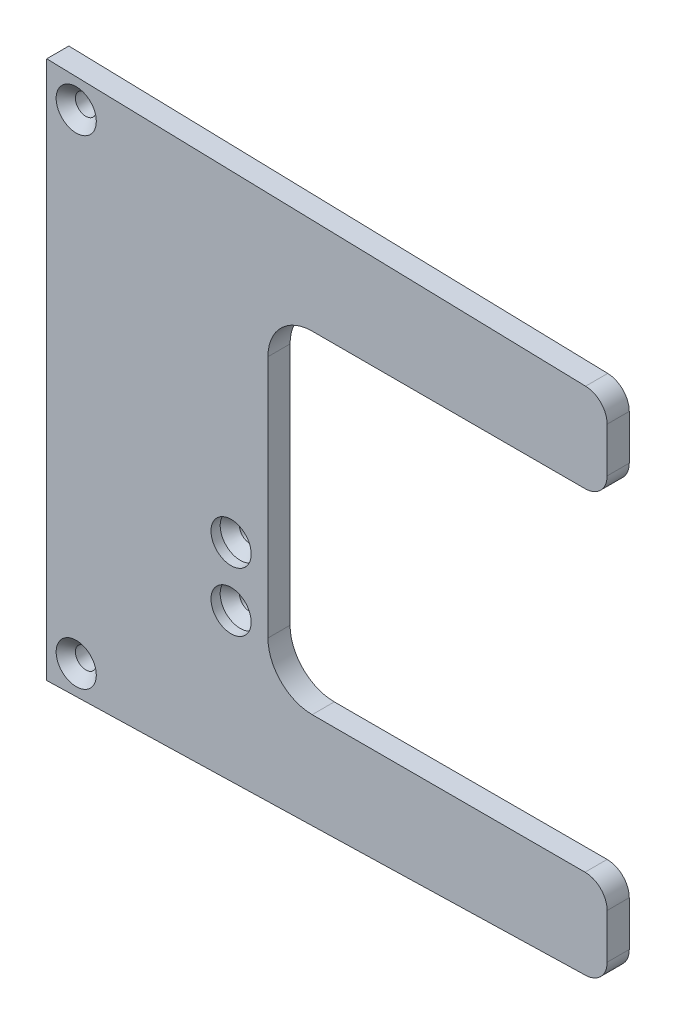
ISO-10303-21;
HEADER;
FILE_DESCRIPTION(('STEP AP214'),'2;1');
FILE_NAME('part.step','',(''),(''),'','','');
FILE_SCHEMA(('AUTOMOTIVE_DESIGN { 1 0 10303 214 1 1 1 1 }'));
ENDSEC;
DATA;
#1=APPLICATION_CONTEXT('core data for automotive mechanical design processes');
#2=APPLICATION_PROTOCOL_DEFINITION('international standard','automotive_design',2000,#1);
#3=PRODUCT_CONTEXT('',#1,'mechanical');
#4=PRODUCT('Part','Part','',(#3));
#5=PRODUCT_RELATED_PRODUCT_CATEGORY('part','',(#4));
#6=PRODUCT_DEFINITION_FORMATION('','',#4);
#7=PRODUCT_DEFINITION_CONTEXT('part definition',#1,'design');
#8=PRODUCT_DEFINITION('design','',#6,#7);
#9=PRODUCT_DEFINITION_SHAPE('','',#8);
#10=(LENGTH_UNIT() NAMED_UNIT(*) SI_UNIT(.MILLI.,.METRE.));
#11=(NAMED_UNIT(*) PLANE_ANGLE_UNIT() SI_UNIT($,.RADIAN.));
#12=(NAMED_UNIT(*) SI_UNIT($,.STERADIAN.) SOLID_ANGLE_UNIT());
#13=UNCERTAINTY_MEASURE_WITH_UNIT(LENGTH_MEASURE(1.E-05),#10,'distance_accuracy_value','');
#14=(GEOMETRIC_REPRESENTATION_CONTEXT(3) GLOBAL_UNCERTAINTY_ASSIGNED_CONTEXT((#13)) GLOBAL_UNIT_ASSIGNED_CONTEXT((#10,
#11,#12)) REPRESENTATION_CONTEXT('',''));
#15=CARTESIAN_POINT('',(0.,0.,0.));
#16=DIRECTION('',(0.,0.,1.));
#17=DIRECTION('',(1.,0.,0.));
#18=AXIS2_PLACEMENT_3D('',#15,#16,#17);
#19=CARTESIAN_POINT('',(-47.625,115.91925,9.525));
#20=DIRECTION('',(1.,0.,0.));
#21=DIRECTION('',(0.,1.,0.));
#22=AXIS2_PLACEMENT_3D('',#19,#20,#21);
#23=PLANE('',#22);
#24=DIRECTION('',(0.,-1.,0.));
#25=VECTOR('',#24,1.);
#26=CARTESIAN_POINT('',(-47.625,115.91925,0.));
#27=LINE('',#26,#25);
#28=CARTESIAN_POINT('',(-47.625,115.91925,0.));
#29=VERTEX_POINT('',#28);
#30=CARTESIAN_POINT('',(-47.625,-115.91925,0.));
#31=VERTEX_POINT('',#30);
#32=EDGE_CURVE('E163',#29,#31,#27,.T.);
#33=ORIENTED_EDGE('',*,*,#32,.T.);
#34=DIRECTION('',(0.,0.,-1.));
#35=VECTOR('',#34,1.);
#36=CARTESIAN_POINT('',(-47.625,-115.91925,9.525));
#37=LINE('',#36,#35);
#38=CARTESIAN_POINT('',(-47.625,-115.91925,9.525));
#39=VERTEX_POINT('',#38);
#40=EDGE_CURVE('E143',#39,#31,#37,.T.);
#41=ORIENTED_EDGE('',*,*,#40,.F.);
#42=DIRECTION('',(0.,-1.,0.));
#43=VECTOR('',#42,1.);
#44=CARTESIAN_POINT('',(-47.625,115.91925,9.525));
#45=LINE('',#44,#43);
#46=CARTESIAN_POINT('',(-47.625,115.91925,9.525));
#47=VERTEX_POINT('',#46);
#48=EDGE_CURVE('E152',#47,#39,#45,.T.);
#49=ORIENTED_EDGE('',*,*,#48,.F.);
#50=DIRECTION('',(0.,0.,-1.));
#51=VECTOR('',#50,1.);
#52=CARTESIAN_POINT('',(-47.625,115.91925,9.525));
#53=LINE('',#52,#51);
#54=EDGE_CURVE('E164',#47,#29,#53,.T.);
#55=ORIENTED_EDGE('',*,*,#54,.T.);
#56=EDGE_LOOP('',(#33,#41,#49,#55));
#57=FACE_BOUND('',#56,.T.);
#58=ADVANCED_FACE('F38',(#57),#23,.F.);
#59=CARTESIAN_POINT('',(47.625,115.91925,9.525));
#60=DIRECTION('',(-1.,0.,0.));
#61=DIRECTION('',(0.,-1.,0.));
#62=AXIS2_PLACEMENT_3D('',#59,#60,#61);
#63=PLANE('',#62);
#64=DIRECTION('',(0.,1.,0.));
#65=VECTOR('',#64,1.);
#66=CARTESIAN_POINT('',(47.625,115.91925,9.525));
#67=LINE('',#66,#65);
#68=CARTESIAN_POINT('',(47.625,-52.4505871253568,9.525));
#69=VERTEX_POINT('',#68);
#70=CARTESIAN_POINT('',(47.625,52.4505871253569,9.525));
#71=VERTEX_POINT('',#70);
#72=EDGE_CURVE('E158',#69,#71,#67,.T.);
#73=ORIENTED_EDGE('',*,*,#72,.F.);
#74=DIRECTION('',(0.,0.,1.));
#75=VECTOR('',#74,1.);
#76=CARTESIAN_POINT('',(47.625,-52.4505871253569,9.525));
#77=LINE('',#76,#75);
#78=CARTESIAN_POINT('',(47.625,-52.4505871253568,0.));
#79=VERTEX_POINT('',#78);
#80=EDGE_CURVE('E210',#69,#79,#77,.F.);
#81=ORIENTED_EDGE('',*,*,#80,.T.);
#82=DIRECTION('',(0.,1.,0.));
#83=VECTOR('',#82,1.);
#84=CARTESIAN_POINT('',(47.625,115.91925,0.));
#85=LINE('',#84,#83);
#86=CARTESIAN_POINT('',(47.625,52.4505871253569,0.));
#87=VERTEX_POINT('',#86);
#88=EDGE_CURVE('E159',#79,#87,#85,.T.);
#89=ORIENTED_EDGE('',*,*,#88,.T.);
#90=DIRECTION('',(0.,0.,1.));
#91=VECTOR('',#90,1.);
#92=CARTESIAN_POINT('',(47.625,52.4505871253569,9.525));
#93=LINE('',#92,#91);
#94=EDGE_CURVE('E207',#87,#71,#93,.T.);
#95=ORIENTED_EDGE('',*,*,#94,.T.);
#96=EDGE_LOOP('',(#73,#81,#89,#95));
#97=FACE_BOUND('',#96,.T.);
#98=ADVANCED_FACE('F240',(#97),#63,.F.);
#99=CARTESIAN_POINT('',(-47.625,-115.91925,9.525));
#100=DIRECTION('',(0.,0.,1.));
#101=DIRECTION('',(1.,0.,0.));
#102=AXIS2_PLACEMENT_3D('',#99,#100,#101);
#103=PLANE('',#102);
#104=DIRECTION('',(-0.999657324975558,-0.0261769483078661,0.));
#105=VECTOR('',#104,1.);
#106=CARTESIAN_POINT('',(47.625,-113.425040970536,9.525));
#107=LINE('',#106,#105);
#108=CARTESIAN_POINT('',(184.399335432632,-109.84347895022,9.525));
#109=VERTEX_POINT('',#108);
#110=EDGE_CURVE('E138',#109,#39,#107,.T.);
#111=ORIENTED_EDGE('',*,*,#110,.F.);
#112=CARTESIAN_POINT('',(184.15,-100.321742929828,9.525));
#113=DIRECTION('',(0.,0.,1.));
#114=DIRECTION('',(1.,0.,0.));
#115=AXIS2_PLACEMENT_3D('',#112,#113,#114);
#116=CIRCLE('',#115,9.525);
#117=CARTESIAN_POINT('',(193.675,-100.321742929828,9.525));
#118=VERTEX_POINT('',#117);
#119=EDGE_CURVE('E176',#109,#118,#116,.T.);
#120=ORIENTED_EDGE('',*,*,#119,.T.);
#121=DIRECTION('',(0.,1.,0.));
#122=VECTOR('',#121,1.);
#123=CARTESIAN_POINT('',(193.675,-71.5005871253569,9.525));
#124=LINE('',#123,#122);
#125=CARTESIAN_POINT('',(193.675,-81.0255871253569,9.525));
#126=VERTEX_POINT('',#125);
#127=EDGE_CURVE('E605',#118,#126,#124,.T.);
#128=ORIENTED_EDGE('',*,*,#127,.T.);
#129=CARTESIAN_POINT('',(184.15,-81.0255871253569,9.52500000000001));
#130=DIRECTION('',(0.,0.,1.));
#131=DIRECTION('',(1.,0.,0.));
#132=AXIS2_PLACEMENT_3D('',#129,#130,#131);
#133=CIRCLE('',#132,9.525);
#134=CARTESIAN_POINT('',(184.15,-71.5005871253569,9.525));
#135=VERTEX_POINT('',#134);
#136=EDGE_CURVE('E174',#126,#135,#133,.T.);
#137=ORIENTED_EDGE('',*,*,#136,.T.);
#138=DIRECTION('',(-1.,0.,0.));
#139=VECTOR('',#138,1.);
#140=CARTESIAN_POINT('',(47.625,-71.5005871253569,9.525));
#141=LINE('',#140,#139);
#142=CARTESIAN_POINT('',(66.675,-71.5005871253569,9.525));
#143=VERTEX_POINT('',#142);
#144=EDGE_CURVE('E238',#135,#143,#141,.T.);
#145=ORIENTED_EDGE('',*,*,#144,.T.);
#146=CARTESIAN_POINT('',(66.675,-52.4505871253569,9.52500000000001));
#147=DIRECTION('',(0.,0.,1.));
#148=DIRECTION('',(1.,0.,0.));
#149=AXIS2_PLACEMENT_3D('',#146,#147,#148);
#150=CIRCLE('',#149,19.05);
#151=EDGE_CURVE('E213',#143,#69,#150,.F.);
#152=ORIENTED_EDGE('',*,*,#151,.T.);
#153=ORIENTED_EDGE('',*,*,#72,.T.);
#154=CARTESIAN_POINT('',(66.675,52.4505871253569,9.525));
#155=DIRECTION('',(0.,0.,1.));
#156=DIRECTION('',(1.,0.,0.));
#157=AXIS2_PLACEMENT_3D('',#154,#155,#156);
#158=CIRCLE('',#157,19.05);
#159=CARTESIAN_POINT('',(66.675,71.5005871253569,9.525));
#160=VERTEX_POINT('',#159);
#161=EDGE_CURVE('E46',#71,#160,#158,.F.);
#162=ORIENTED_EDGE('',*,*,#161,.T.);
#163=DIRECTION('',(1.,0.,0.));
#164=VECTOR('',#163,1.);
#165=CARTESIAN_POINT('',(193.675,71.5005871253569,9.525));
#166=LINE('',#165,#164);
#167=CARTESIAN_POINT('',(184.15,71.5005871253569,9.525));
#168=VERTEX_POINT('',#167);
#169=EDGE_CURVE('E233',#160,#168,#166,.T.);
#170=ORIENTED_EDGE('',*,*,#169,.T.);
#171=CARTESIAN_POINT('',(184.15,81.0255871253569,9.52500000000001));
#172=DIRECTION('',(0.,0.,1.));
#173=DIRECTION('',(1.,0.,0.));
#174=AXIS2_PLACEMENT_3D('',#171,#172,#173);
#175=CIRCLE('',#174,9.525);
#176=CARTESIAN_POINT('',(193.675,81.0255871253569,9.525));
#177=VERTEX_POINT('',#176);
#178=EDGE_CURVE('E172',#168,#177,#175,.T.);
#179=ORIENTED_EDGE('',*,*,#178,.T.);
#180=DIRECTION('',(0.,1.,0.));
#181=VECTOR('',#180,1.);
#182=CARTESIAN_POINT('',(193.675,109.600587125357,9.525));
#183=LINE('',#182,#181);
#184=CARTESIAN_POINT('',(193.675,100.321742929828,9.525));
#185=VERTEX_POINT('',#184);
#186=EDGE_CURVE('E255',#177,#185,#183,.T.);
#187=ORIENTED_EDGE('',*,*,#186,.T.);
#188=CARTESIAN_POINT('',(184.15,100.321742929828,9.52500000000001));
#189=DIRECTION('',(0.,0.,1.));
#190=DIRECTION('',(1.,0.,0.));
#191=AXIS2_PLACEMENT_3D('',#188,#189,#190);
#192=CIRCLE('',#191,9.525);
#193=CARTESIAN_POINT('',(184.399335432632,109.84347895022,9.525));
#194=VERTEX_POINT('',#193);
#195=EDGE_CURVE('E166',#185,#194,#192,.T.);
#196=ORIENTED_EDGE('',*,*,#195,.T.);
#197=DIRECTION('',(0.999657324975557,-0.026176948307866,0.));
#198=VECTOR('',#197,1.);
#199=CARTESIAN_POINT('',(-47.625,115.91925,9.525));
#200=LINE('',#199,#198);
#201=EDGE_CURVE('E147',#47,#194,#200,.T.);
#202=ORIENTED_EDGE('',*,*,#201,.F.);
#203=ORIENTED_EDGE('',*,*,#48,.T.);
#204=EDGE_LOOP('',(#111,#120,#128,#137,#145,#152,#153,#162,#170,#179,#187,#196,#202,#203));
#205=FACE_BOUND('',#204,.T.);
#206=CARTESIAN_POINT('',(-34.925,103.21925,9.525));
#207=DIRECTION('',(0.,0.,1.));
#208=DIRECTION('',(1.,0.,0.));
#209=AXIS2_PLACEMENT_3D('',#206,#207,#208);
#210=CIRCLE('',#209,8.65);
#211=CARTESIAN_POINT('',(-26.275,103.21925,9.525));
#212=VERTEX_POINT('',#211);
#213=EDGE_CURVE('E263',#212,#212,#210,.T.);
#214=ORIENTED_EDGE('',*,*,#213,.F.);
#215=EDGE_LOOP('',(#214));
#216=FACE_BOUND('',#215,.T.);
#217=CARTESIAN_POINT('',(-34.925,-103.21925,9.525));
#218=DIRECTION('',(0.,0.,1.));
#219=DIRECTION('',(1.,0.,0.));
#220=AXIS2_PLACEMENT_3D('',#217,#218,#219);
#221=CIRCLE('',#220,8.65);
#222=CARTESIAN_POINT('',(-26.275,-103.21925,9.525));
#223=VERTEX_POINT('',#222);
#224=EDGE_CURVE('E272',#223,#223,#221,.T.);
#225=ORIENTED_EDGE('',*,*,#224,.F.);
#226=EDGE_LOOP('',(#225));
#227=FACE_BOUND('',#226,.T.);
#228=CARTESIAN_POINT('',(31.75,-50.15865,9.525));
#229=DIRECTION('',(0.,0.,1.));
#230=DIRECTION('',(1.,0.,0.));
#231=AXIS2_PLACEMENT_3D('',#228,#229,#230);
#232=CIRCLE('',#231,8.65);
#233=CARTESIAN_POINT('',(40.4,-50.15865,9.525));
#234=VERTEX_POINT('',#233);
#235=EDGE_CURVE('E290',#234,#234,#232,.T.);
#236=ORIENTED_EDGE('',*,*,#235,.F.);
#237=EDGE_LOOP('',(#236));
#238=FACE_BOUND('',#237,.T.);
#239=CARTESIAN_POINT('',(31.75,-24.75865,9.525));
#240=DIRECTION('',(0.,0.,1.));
#241=DIRECTION('',(1.,0.,0.));
#242=AXIS2_PLACEMENT_3D('',#239,#240,#241);
#243=CIRCLE('',#242,8.65);
#244=CARTESIAN_POINT('',(40.4,-24.75865,9.525));
#245=VERTEX_POINT('',#244);
#246=EDGE_CURVE('E245',#245,#245,#243,.T.);
#247=ORIENTED_EDGE('',*,*,#246,.F.);
#248=EDGE_LOOP('',(#247));
#249=FACE_BOUND('',#248,.T.);
#250=ADVANCED_FACE('F153',(#205,#216,#227,#238,#249),#103,.T.);
#251=CARTESIAN_POINT('',(-47.625,-115.91925,0.));
#252=DIRECTION('',(0.,0.,1.));
#253=DIRECTION('',(1.,0.,0.));
#254=AXIS2_PLACEMENT_3D('',#251,#252,#253);
#255=PLANE('',#254);
#256=CARTESIAN_POINT('',(-34.925,103.21925,0.));
#257=DIRECTION('',(0.,0.,1.));
#258=DIRECTION('',(1.,0.,0.));
#259=AXIS2_PLACEMENT_3D('',#256,#257,#258);
#260=CIRCLE('',#259,4.49999999999999);
#261=CARTESIAN_POINT('',(-30.425,103.21925,0.));
#262=VERTEX_POINT('',#261);
#263=EDGE_CURVE('E269',#262,#262,#260,.T.);
#264=ORIENTED_EDGE('',*,*,#263,.T.);
#265=EDGE_LOOP('',(#264));
#266=FACE_BOUND('',#265,.T.);
#267=CARTESIAN_POINT('',(-34.925,-103.21925,0.));
#268=DIRECTION('',(0.,0.,1.));
#269=DIRECTION('',(1.,0.,0.));
#270=AXIS2_PLACEMENT_3D('',#267,#268,#269);
#271=CIRCLE('',#270,4.49999999999999);
#272=CARTESIAN_POINT('',(-30.425,-103.21925,0.));
#273=VERTEX_POINT('',#272);
#274=EDGE_CURVE('E278',#273,#273,#271,.T.);
#275=ORIENTED_EDGE('',*,*,#274,.T.);
#276=EDGE_LOOP('',(#275));
#277=FACE_BOUND('',#276,.T.);
#278=CARTESIAN_POINT('',(31.75,-50.15865,0.));
#279=DIRECTION('',(0.,0.,1.));
#280=DIRECTION('',(1.,0.,0.));
#281=AXIS2_PLACEMENT_3D('',#278,#279,#280);
#282=CIRCLE('',#281,4.5);
#283=CARTESIAN_POINT('',(36.25,-50.15865,0.));
#284=VERTEX_POINT('',#283);
#285=EDGE_CURVE('E281',#284,#284,#282,.T.);
#286=ORIENTED_EDGE('',*,*,#285,.T.);
#287=EDGE_LOOP('',(#286));
#288=FACE_BOUND('',#287,.T.);
#289=CARTESIAN_POINT('',(31.75,-24.75865,0.));
#290=DIRECTION('',(0.,0.,1.));
#291=DIRECTION('',(1.,0.,0.));
#292=AXIS2_PLACEMENT_3D('',#289,#290,#291);
#293=CIRCLE('',#292,4.5);
#294=CARTESIAN_POINT('',(36.25,-24.75865,0.));
#295=VERTEX_POINT('',#294);
#296=EDGE_CURVE('E293',#295,#295,#293,.T.);
#297=ORIENTED_EDGE('',*,*,#296,.T.);
#298=EDGE_LOOP('',(#297));
#299=FACE_BOUND('',#298,.T.);
#300=DIRECTION('',(0.,-1.,0.));
#301=VECTOR('',#300,1.);
#302=CARTESIAN_POINT('',(193.675,-71.5005871253569,0.));
#303=LINE('',#302,#301);
#304=CARTESIAN_POINT('',(193.675,-81.0255871253569,0.));
#305=VERTEX_POINT('',#304);
#306=CARTESIAN_POINT('',(193.675,-100.321742929828,0.));
#307=VERTEX_POINT('',#306);
#308=EDGE_CURVE('E234',#305,#307,#303,.T.);
#309=ORIENTED_EDGE('',*,*,#308,.T.);
#310=CARTESIAN_POINT('',(184.15,-100.321742929828,0.));
#311=DIRECTION('',(0.,0.,1.));
#312=DIRECTION('',(1.,0.,0.));
#313=AXIS2_PLACEMENT_3D('',#310,#311,#312);
#314=CIRCLE('',#313,9.525);
#315=CARTESIAN_POINT('',(184.399335432632,-109.84347895022,0.));
#316=VERTEX_POINT('',#315);
#317=EDGE_CURVE('E189',#307,#316,#314,.F.);
#318=ORIENTED_EDGE('',*,*,#317,.T.);
#319=DIRECTION('',(0.999657324975558,0.0261769483078661,0.));
#320=VECTOR('',#319,1.);
#321=CARTESIAN_POINT('',(47.625,-113.425040970536,0.));
#322=LINE('',#321,#320);
#323=EDGE_CURVE('E148',#31,#316,#322,.T.);
#324=ORIENTED_EDGE('',*,*,#323,.F.);
#325=ORIENTED_EDGE('',*,*,#32,.F.);
#326=DIRECTION('',(-0.999657324975558,0.026176948307866,0.));
#327=VECTOR('',#326,1.);
#328=CARTESIAN_POINT('',(-47.625,115.91925,0.));
#329=LINE('',#328,#327);
#330=CARTESIAN_POINT('',(184.399335432632,109.84347895022,0.));
#331=VERTEX_POINT('',#330);
#332=EDGE_CURVE('E261',#331,#29,#329,.T.);
#333=ORIENTED_EDGE('',*,*,#332,.F.);
#334=CARTESIAN_POINT('',(184.15,100.321742929828,0.));
#335=DIRECTION('',(0.,0.,1.));
#336=DIRECTION('',(1.,0.,0.));
#337=AXIS2_PLACEMENT_3D('',#334,#335,#336);
#338=CIRCLE('',#337,9.525);
#339=CARTESIAN_POINT('',(193.675,100.321742929828,0.));
#340=VERTEX_POINT('',#339);
#341=EDGE_CURVE('E183',#331,#340,#338,.F.);
#342=ORIENTED_EDGE('',*,*,#341,.T.);
#343=DIRECTION('',(0.,-1.,0.));
#344=VECTOR('',#343,1.);
#345=CARTESIAN_POINT('',(193.675,109.600587125357,0.));
#346=LINE('',#345,#344);
#347=CARTESIAN_POINT('',(193.675,81.0255871253569,0.));
#348=VERTEX_POINT('',#347);
#349=EDGE_CURVE('E252',#340,#348,#346,.T.);
#350=ORIENTED_EDGE('',*,*,#349,.T.);
#351=CARTESIAN_POINT('',(184.15,81.0255871253569,0.));
#352=DIRECTION('',(0.,0.,1.));
#353=DIRECTION('',(1.,0.,0.));
#354=AXIS2_PLACEMENT_3D('',#351,#352,#353);
#355=CIRCLE('',#354,9.525);
#356=CARTESIAN_POINT('',(184.15,71.5005871253569,0.));
#357=VERTEX_POINT('',#356);
#358=EDGE_CURVE('E185',#348,#357,#355,.F.);
#359=ORIENTED_EDGE('',*,*,#358,.T.);
#360=DIRECTION('',(-1.,0.,0.));
#361=VECTOR('',#360,1.);
#362=CARTESIAN_POINT('',(193.675,71.5005871253569,0.));
#363=LINE('',#362,#361);
#364=CARTESIAN_POINT('',(66.675,71.5005871253569,0.));
#365=VERTEX_POINT('',#364);
#366=EDGE_CURVE('E248',#357,#365,#363,.T.);
#367=ORIENTED_EDGE('',*,*,#366,.T.);
#368=CARTESIAN_POINT('',(66.675,52.4505871253569,0.));
#369=DIRECTION('',(0.,0.,1.));
#370=DIRECTION('',(1.,0.,0.));
#371=AXIS2_PLACEMENT_3D('',#368,#369,#370);
#372=CIRCLE('',#371,19.05);
#373=EDGE_CURVE('E11',#365,#87,#372,.T.);
#374=ORIENTED_EDGE('',*,*,#373,.T.);
#375=ORIENTED_EDGE('',*,*,#88,.F.);
#376=CARTESIAN_POINT('',(66.675,-52.4505871253569,0.));
#377=DIRECTION('',(0.,0.,1.));
#378=DIRECTION('',(1.,0.,0.));
#379=AXIS2_PLACEMENT_3D('',#376,#377,#378);
#380=CIRCLE('',#379,19.05);
#381=CARTESIAN_POINT('',(66.675,-71.5005871253569,0.));
#382=VERTEX_POINT('',#381);
#383=EDGE_CURVE('E215',#79,#382,#380,.T.);
#384=ORIENTED_EDGE('',*,*,#383,.T.);
#385=DIRECTION('',(1.,0.,0.));
#386=VECTOR('',#385,1.);
#387=CARTESIAN_POINT('',(47.625,-71.5005871253569,0.));
#388=LINE('',#387,#386);
#389=CARTESIAN_POINT('',(184.15,-71.5005871253569,0.));
#390=VERTEX_POINT('',#389);
#391=EDGE_CURVE('E222',#382,#390,#388,.T.);
#392=ORIENTED_EDGE('',*,*,#391,.T.);
#393=CARTESIAN_POINT('',(184.15,-81.0255871253569,0.));
#394=DIRECTION('',(0.,0.,1.));
#395=DIRECTION('',(1.,0.,0.));
#396=AXIS2_PLACEMENT_3D('',#393,#394,#395);
#397=CIRCLE('',#396,9.525);
#398=EDGE_CURVE('E187',#390,#305,#397,.F.);
#399=ORIENTED_EDGE('',*,*,#398,.T.);
#400=EDGE_LOOP('',(#309,#318,#324,#325,#333,#342,#350,#359,#367,#374,#375,#384,#392,#399));
#401=FACE_BOUND('',#400,.T.);
#402=ADVANCED_FACE('F221',(#266,#277,#288,#299,#401),#255,.F.);
#403=CARTESIAN_POINT('',(31.75,-24.75865,9.525));
#404=DIRECTION('',(0.,0.,1.));
#405=DIRECTION('',(1.,0.,0.));
#406=AXIS2_PLACEMENT_3D('',#403,#404,#405);
#407=CYLINDRICAL_SURFACE('',#406,8.65);
#408=CARTESIAN_POINT('',(31.75,-24.75865,5.5626));
#409=DIRECTION('',(0.,0.,1.));
#410=DIRECTION('',(1.,0.,0.));
#411=AXIS2_PLACEMENT_3D('',#408,#409,#410);
#412=CIRCLE('',#411,8.65);
#413=CARTESIAN_POINT('',(40.4,-24.75865,5.5626));
#414=VERTEX_POINT('',#413);
#415=EDGE_CURVE('E299',#414,#414,#412,.T.);
#416=ORIENTED_EDGE('',*,*,#415,.F.);
#417=EDGE_LOOP('',(#416));
#418=FACE_BOUND('',#417,.T.);
#419=ORIENTED_EDGE('',*,*,#246,.T.);
#420=EDGE_LOOP('',(#419));
#421=FACE_BOUND('',#420,.T.);
#422=ADVANCED_FACE('F304',(#418,#421),#407,.F.);
#423=CARTESIAN_POINT('',(31.75,-24.75865,5.5626));
#424=DIRECTION('',(0.,0.,1.));
#425=DIRECTION('',(1.,0.,0.));
#426=AXIS2_PLACEMENT_3D('',#423,#424,#425);
#427=CONICAL_SURFACE('',#426,8.65,0.785398163397449);
#428=CARTESIAN_POINT('',(31.75,-24.75865,1.41260000000001));
#429=DIRECTION('',(0.,0.,1.));
#430=DIRECTION('',(1.,0.,0.));
#431=AXIS2_PLACEMENT_3D('',#428,#429,#430);
#432=CIRCLE('',#431,4.5);
#433=CARTESIAN_POINT('',(36.25,-24.75865,1.41260000000001));
#434=VERTEX_POINT('',#433);
#435=EDGE_CURVE('E296',#434,#434,#432,.T.);
#436=ORIENTED_EDGE('',*,*,#435,.F.);
#437=EDGE_LOOP('',(#436));
#438=FACE_BOUND('',#437,.T.);
#439=ORIENTED_EDGE('',*,*,#415,.T.);
#440=EDGE_LOOP('',(#439));
#441=FACE_BOUND('',#440,.T.);
#442=ADVANCED_FACE('F531',(#438,#441),#427,.F.);
#443=CARTESIAN_POINT('',(31.75,-24.75865,9.525));
#444=DIRECTION('',(0.,0.,1.));
#445=DIRECTION('',(1.,0.,0.));
#446=AXIS2_PLACEMENT_3D('',#443,#444,#445);
#447=CYLINDRICAL_SURFACE('',#446,4.5);
#448=ORIENTED_EDGE('',*,*,#296,.F.);
#449=EDGE_LOOP('',(#448));
#450=FACE_BOUND('',#449,.T.);
#451=ORIENTED_EDGE('',*,*,#435,.T.);
#452=EDGE_LOOP('',(#451));
#453=FACE_BOUND('',#452,.T.);
#454=ADVANCED_FACE('F521',(#450,#453),#447,.F.);
#455=CARTESIAN_POINT('',(31.75,-50.15865,9.525));
#456=DIRECTION('',(0.,0.,1.));
#457=DIRECTION('',(1.,0.,0.));
#458=AXIS2_PLACEMENT_3D('',#455,#456,#457);
#459=CYLINDRICAL_SURFACE('',#458,8.65);
#460=CARTESIAN_POINT('',(31.75,-50.15865,5.5626));
#461=DIRECTION('',(0.,0.,1.));
#462=DIRECTION('',(1.,0.,0.));
#463=AXIS2_PLACEMENT_3D('',#460,#461,#462);
#464=CIRCLE('',#463,8.65);
#465=CARTESIAN_POINT('',(40.4,-50.15865,5.5626));
#466=VERTEX_POINT('',#465);
#467=EDGE_CURVE('E287',#466,#466,#464,.T.);
#468=ORIENTED_EDGE('',*,*,#467,.F.);
#469=EDGE_LOOP('',(#468));
#470=FACE_BOUND('',#469,.T.);
#471=ORIENTED_EDGE('',*,*,#235,.T.);
#472=EDGE_LOOP('',(#471));
#473=FACE_BOUND('',#472,.T.);
#474=ADVANCED_FACE('F511',(#470,#473),#459,.F.);
#475=CARTESIAN_POINT('',(31.75,-50.15865,5.5626));
#476=DIRECTION('',(0.,0.,1.));
#477=DIRECTION('',(1.,0.,0.));
#478=AXIS2_PLACEMENT_3D('',#475,#476,#477);
#479=CONICAL_SURFACE('',#478,8.65,0.785398163397449);
#480=CARTESIAN_POINT('',(31.75,-50.15865,1.41260000000001));
#481=DIRECTION('',(0.,0.,1.));
#482=DIRECTION('',(1.,0.,0.));
#483=AXIS2_PLACEMENT_3D('',#480,#481,#482);
#484=CIRCLE('',#483,4.5);
#485=CARTESIAN_POINT('',(36.25,-50.15865,1.41260000000001));
#486=VERTEX_POINT('',#485);
#487=EDGE_CURVE('E284',#486,#486,#484,.T.);
#488=ORIENTED_EDGE('',*,*,#487,.F.);
#489=EDGE_LOOP('',(#488));
#490=FACE_BOUND('',#489,.T.);
#491=ORIENTED_EDGE('',*,*,#467,.T.);
#492=EDGE_LOOP('',(#491));
#493=FACE_BOUND('',#492,.T.);
#494=ADVANCED_FACE('F501',(#490,#493),#479,.F.);
#495=CARTESIAN_POINT('',(31.75,-50.15865,9.525));
#496=DIRECTION('',(0.,0.,1.));
#497=DIRECTION('',(1.,0.,0.));
#498=AXIS2_PLACEMENT_3D('',#495,#496,#497);
#499=CYLINDRICAL_SURFACE('',#498,4.5);
#500=ORIENTED_EDGE('',*,*,#285,.F.);
#501=EDGE_LOOP('',(#500));
#502=FACE_BOUND('',#501,.T.);
#503=ORIENTED_EDGE('',*,*,#487,.T.);
#504=EDGE_LOOP('',(#503));
#505=FACE_BOUND('',#504,.T.);
#506=ADVANCED_FACE('F491',(#502,#505),#499,.F.);
#507=CARTESIAN_POINT('',(-34.925,-103.21925,9.525));
#508=DIRECTION('',(0.,0.,1.));
#509=DIRECTION('',(1.,0.,0.));
#510=AXIS2_PLACEMENT_3D('',#507,#508,#509);
#511=CYLINDRICAL_SURFACE('',#510,4.49999999999999);
#512=ORIENTED_EDGE('',*,*,#274,.F.);
#513=EDGE_LOOP('',(#512));
#514=FACE_BOUND('',#513,.T.);
#515=CARTESIAN_POINT('',(-34.925,-103.21925,5.375));
#516=DIRECTION('',(0.,0.,1.));
#517=DIRECTION('',(1.,0.,0.));
#518=AXIS2_PLACEMENT_3D('',#515,#516,#517);
#519=CIRCLE('',#518,4.5);
#520=CARTESIAN_POINT('',(-30.425,-103.21925,5.375));
#521=VERTEX_POINT('',#520);
#522=EDGE_CURVE('E275',#521,#521,#519,.T.);
#523=ORIENTED_EDGE('',*,*,#522,.T.);
#524=EDGE_LOOP('',(#523));
#525=FACE_BOUND('',#524,.T.);
#526=ADVANCED_FACE('F481',(#514,#525),#511,.F.);
#527=CARTESIAN_POINT('',(-34.925,-103.21925,9.525));
#528=DIRECTION('',(0.,0.,1.));
#529=DIRECTION('',(1.,0.,0.));
#530=AXIS2_PLACEMENT_3D('',#527,#528,#529);
#531=CONICAL_SURFACE('',#530,8.65,0.785398163397448);
#532=ORIENTED_EDGE('',*,*,#522,.F.);
#533=EDGE_LOOP('',(#532));
#534=FACE_BOUND('',#533,.T.);
#535=ORIENTED_EDGE('',*,*,#224,.T.);
#536=EDGE_LOOP('',(#535));
#537=FACE_BOUND('',#536,.T.);
#538=ADVANCED_FACE('F471',(#534,#537),#531,.F.);
#539=CARTESIAN_POINT('',(-34.925,103.21925,9.525));
#540=DIRECTION('',(0.,0.,1.));
#541=DIRECTION('',(1.,0.,0.));
#542=AXIS2_PLACEMENT_3D('',#539,#540,#541);
#543=CYLINDRICAL_SURFACE('',#542,4.49999999999999);
#544=ORIENTED_EDGE('',*,*,#263,.F.);
#545=EDGE_LOOP('',(#544));
#546=FACE_BOUND('',#545,.T.);
#547=CARTESIAN_POINT('',(-34.925,103.21925,5.375));
#548=DIRECTION('',(0.,0.,1.));
#549=DIRECTION('',(1.,0.,0.));
#550=AXIS2_PLACEMENT_3D('',#547,#548,#549);
#551=CIRCLE('',#550,4.5);
#552=CARTESIAN_POINT('',(-30.425,103.21925,5.375));
#553=VERTEX_POINT('',#552);
#554=EDGE_CURVE('E266',#553,#553,#551,.T.);
#555=ORIENTED_EDGE('',*,*,#554,.T.);
#556=EDGE_LOOP('',(#555));
#557=FACE_BOUND('',#556,.T.);
#558=ADVANCED_FACE('F461',(#546,#557),#543,.F.);
#559=CARTESIAN_POINT('',(-34.925,103.21925,9.525));
#560=DIRECTION('',(0.,0.,1.));
#561=DIRECTION('',(1.,0.,0.));
#562=AXIS2_PLACEMENT_3D('',#559,#560,#561);
#563=CONICAL_SURFACE('',#562,8.65,0.785398163397448);
#564=ORIENTED_EDGE('',*,*,#554,.F.);
#565=EDGE_LOOP('',(#564));
#566=FACE_BOUND('',#565,.T.);
#567=ORIENTED_EDGE('',*,*,#213,.T.);
#568=EDGE_LOOP('',(#567));
#569=FACE_BOUND('',#568,.T.);
#570=ADVANCED_FACE('F446',(#566,#569),#563,.F.);
#571=CARTESIAN_POINT('',(-47.625,115.91925,-0.00100000000000447));
#572=DIRECTION('',(-0.026176948307866,-0.999657324975557,0.));
#573=DIRECTION('',(0.999657324975558,-0.026176948307866,0.));
#574=AXIS2_PLACEMENT_3D('',#571,#572,#573);
#575=PLANE('',#574);
#576=ORIENTED_EDGE('',*,*,#201,.T.);
#577=DIRECTION('',(0.,0.,1.));
#578=VECTOR('',#577,1.);
#579=CARTESIAN_POINT('',(184.399335432632,109.84347895022,0.));
#580=LINE('',#579,#578);
#581=EDGE_CURVE('E202',#194,#331,#580,.F.);
#582=ORIENTED_EDGE('',*,*,#581,.T.);
#583=ORIENTED_EDGE('',*,*,#332,.T.);
#584=ORIENTED_EDGE('',*,*,#54,.F.);
#585=EDGE_LOOP('',(#576,#582,#583,#584));
#586=FACE_BOUND('',#585,.T.);
#587=ADVANCED_FACE('F438',(#586),#575,.F.);
#588=CARTESIAN_POINT('',(47.625,-113.425040970536,-0.00100000000000447));
#589=DIRECTION('',(-0.0261769483078661,0.999657324975557,0.));
#590=DIRECTION('',(-0.999657324975558,-0.0261769483078661,0.));
#591=AXIS2_PLACEMENT_3D('',#588,#589,#590);
#592=PLANE('',#591);
#593=ORIENTED_EDGE('',*,*,#323,.T.);
#594=DIRECTION('',(0.,0.,1.));
#595=VECTOR('',#594,1.);
#596=CARTESIAN_POINT('',(184.399335432632,-109.84347895022,9.525));
#597=LINE('',#596,#595);
#598=EDGE_CURVE('E146',#316,#109,#597,.T.);
#599=ORIENTED_EDGE('',*,*,#598,.T.);
#600=ORIENTED_EDGE('',*,*,#110,.T.);
#601=ORIENTED_EDGE('',*,*,#40,.T.);
#602=EDGE_LOOP('',(#593,#599,#600,#601));
#603=FACE_BOUND('',#602,.T.);
#604=ADVANCED_FACE('F141',(#603),#592,.F.);
#605=CARTESIAN_POINT('',(193.675,109.600587125357,-151.948222530626));
#606=DIRECTION('',(1.,0.,0.));
#607=DIRECTION('',(0.,0.,-1.));
#608=AXIS2_PLACEMENT_3D('',#605,#606,#607);
#609=PLANE('',#608);
#610=ORIENTED_EDGE('',*,*,#186,.F.);
#611=DIRECTION('',(0.,0.,1.));
#612=VECTOR('',#611,1.);
#613=CARTESIAN_POINT('',(193.675,81.0255871253569,-151.948222530626));
#614=LINE('',#613,#612);
#615=EDGE_CURVE('E200',#177,#348,#614,.F.);
#616=ORIENTED_EDGE('',*,*,#615,.T.);
#617=ORIENTED_EDGE('',*,*,#349,.F.);
#618=DIRECTION('',(0.,0.,1.));
#619=VECTOR('',#618,1.);
#620=CARTESIAN_POINT('',(193.675,100.321742929828,9.52500000000001));
#621=LINE('',#620,#619);
#622=EDGE_CURVE('E197',#340,#185,#621,.T.);
#623=ORIENTED_EDGE('',*,*,#622,.T.);
#624=EDGE_LOOP('',(#610,#616,#617,#623));
#625=FACE_BOUND('',#624,.T.);
#626=ADVANCED_FACE('F368',(#625),#609,.T.);
#627=CARTESIAN_POINT('',(193.675,71.5005871253569,-151.948222530626));
#628=DIRECTION('',(0.,-1.,0.));
#629=DIRECTION('',(1.,0.,0.));
#630=AXIS2_PLACEMENT_3D('',#627,#628,#629);
#631=PLANE('',#630);
#632=ORIENTED_EDGE('',*,*,#169,.F.);
#633=DIRECTION('',(0.,0.,1.));
#634=VECTOR('',#633,1.);
#635=CARTESIAN_POINT('',(66.675,71.5005871253569,-151.948222530626));
#636=LINE('',#635,#634);
#637=EDGE_CURVE('E59',#160,#365,#636,.F.);
#638=ORIENTED_EDGE('',*,*,#637,.T.);
#639=ORIENTED_EDGE('',*,*,#366,.F.);
#640=DIRECTION('',(0.,0.,1.));
#641=VECTOR('',#640,1.);
#642=CARTESIAN_POINT('',(184.15,71.5005871253569,-151.948222530626));
#643=LINE('',#642,#641);
#644=EDGE_CURVE('E194',#357,#168,#643,.T.);
#645=ORIENTED_EDGE('',*,*,#644,.T.);
#646=EDGE_LOOP('',(#632,#638,#639,#645));
#647=FACE_BOUND('',#646,.T.);
#648=ADVANCED_FACE('F357',(#647),#631,.T.);
#649=CARTESIAN_POINT('',(47.625,-71.5005871253569,-151.948222530626));
#650=DIRECTION('',(0.,1.,0.));
#651=DIRECTION('',(0.,0.,1.));
#652=AXIS2_PLACEMENT_3D('',#649,#650,#651);
#653=PLANE('',#652);
#654=ORIENTED_EDGE('',*,*,#391,.F.);
#655=DIRECTION('',(0.,0.,1.));
#656=VECTOR('',#655,1.);
#657=CARTESIAN_POINT('',(66.675,-71.5005871253569,-151.948222530626));
#658=LINE('',#657,#656);
#659=EDGE_CURVE('E204',#382,#143,#658,.T.);
#660=ORIENTED_EDGE('',*,*,#659,.T.);
#661=ORIENTED_EDGE('',*,*,#144,.F.);
#662=DIRECTION('',(0.,0.,1.));
#663=VECTOR('',#662,1.);
#664=CARTESIAN_POINT('',(184.15,-71.5005871253569,-151.948222530626));
#665=LINE('',#664,#663);
#666=EDGE_CURVE('E191',#135,#390,#665,.F.);
#667=ORIENTED_EDGE('',*,*,#666,.T.);
#668=EDGE_LOOP('',(#654,#660,#661,#667));
#669=FACE_BOUND('',#668,.T.);
#670=ADVANCED_FACE('F228',(#669),#653,.T.);
#671=CARTESIAN_POINT('',(193.675,-71.5005871253569,-151.948222530626));
#672=DIRECTION('',(1.,0.,0.));
#673=DIRECTION('',(0.,1.,0.));
#674=AXIS2_PLACEMENT_3D('',#671,#672,#673);
#675=PLANE('',#674);
#676=ORIENTED_EDGE('',*,*,#127,.F.);
#677=DIRECTION('',(0.,0.,1.));
#678=VECTOR('',#677,1.);
#679=CARTESIAN_POINT('',(193.675,-100.321742929828,0.));
#680=LINE('',#679,#678);
#681=EDGE_CURVE('E181',#118,#307,#680,.F.);
#682=ORIENTED_EDGE('',*,*,#681,.T.);
#683=ORIENTED_EDGE('',*,*,#308,.F.);
#684=DIRECTION('',(0.,0.,1.));
#685=VECTOR('',#684,1.);
#686=CARTESIAN_POINT('',(193.675,-81.0255871253569,-151.948222530626));
#687=LINE('',#686,#685);
#688=EDGE_CURVE('E178',#305,#126,#687,.T.);
#689=ORIENTED_EDGE('',*,*,#688,.T.);
#690=EDGE_LOOP('',(#676,#682,#683,#689));
#691=FACE_BOUND('',#690,.T.);
#692=ADVANCED_FACE('F325',(#691),#675,.T.);
#693=CARTESIAN_POINT('',(184.15,-100.321742929828,-0.00100000000000447));
#694=DIRECTION('',(0.,0.,-1.));
#695=DIRECTION('',(-1.,0.,0.));
#696=AXIS2_PLACEMENT_3D('',#693,#694,#695);
#697=CYLINDRICAL_SURFACE('',#696,9.525);
#698=ORIENTED_EDGE('',*,*,#317,.F.);
#699=ORIENTED_EDGE('',*,*,#681,.F.);
#700=ORIENTED_EDGE('',*,*,#119,.F.);
#701=ORIENTED_EDGE('',*,*,#598,.F.);
#702=EDGE_LOOP('',(#698,#699,#700,#701));
#703=FACE_BOUND('',#702,.T.);
#704=ADVANCED_FACE('F321',(#703),#697,.T.);
#705=CARTESIAN_POINT('',(184.15,-81.0255871253569,-151.948222530626));
#706=DIRECTION('',(0.,0.,1.));
#707=DIRECTION('',(1.,0.,0.));
#708=AXIS2_PLACEMENT_3D('',#705,#706,#707);
#709=CYLINDRICAL_SURFACE('',#708,9.525);
#710=ORIENTED_EDGE('',*,*,#398,.F.);
#711=ORIENTED_EDGE('',*,*,#666,.F.);
#712=ORIENTED_EDGE('',*,*,#136,.F.);
#713=ORIENTED_EDGE('',*,*,#688,.F.);
#714=EDGE_LOOP('',(#710,#711,#712,#713));
#715=FACE_BOUND('',#714,.T.);
#716=ADVANCED_FACE('F324',(#715),#709,.T.);
#717=CARTESIAN_POINT('',(184.15,81.0255871253569,-151.948222530626));
#718=DIRECTION('',(0.,0.,1.));
#719=DIRECTION('',(1.,0.,0.));
#720=AXIS2_PLACEMENT_3D('',#717,#718,#719);
#721=CYLINDRICAL_SURFACE('',#720,9.525);
#722=ORIENTED_EDGE('',*,*,#358,.F.);
#723=ORIENTED_EDGE('',*,*,#615,.F.);
#724=ORIENTED_EDGE('',*,*,#178,.F.);
#725=ORIENTED_EDGE('',*,*,#644,.F.);
#726=EDGE_LOOP('',(#722,#723,#724,#725));
#727=FACE_BOUND('',#726,.T.);
#728=ADVANCED_FACE('F329',(#727),#721,.T.);
#729=CARTESIAN_POINT('',(184.15,100.321742929828,-151.948222530626));
#730=DIRECTION('',(0.,0.,-1.));
#731=DIRECTION('',(-1.,0.,0.));
#732=AXIS2_PLACEMENT_3D('',#729,#730,#731);
#733=CYLINDRICAL_SURFACE('',#732,9.525);
#734=ORIENTED_EDGE('',*,*,#341,.F.);
#735=ORIENTED_EDGE('',*,*,#581,.F.);
#736=ORIENTED_EDGE('',*,*,#195,.F.);
#737=ORIENTED_EDGE('',*,*,#622,.F.);
#738=EDGE_LOOP('',(#734,#735,#736,#737));
#739=FACE_BOUND('',#738,.T.);
#740=ADVANCED_FACE('F333',(#739),#733,.T.);
#741=CARTESIAN_POINT('',(66.675,-52.4505871253569,-151.948222530626));
#742=DIRECTION('',(0.,0.,1.));
#743=DIRECTION('',(1.,0.,0.));
#744=AXIS2_PLACEMENT_3D('',#741,#742,#743);
#745=CYLINDRICAL_SURFACE('',#744,19.05);
#746=ORIENTED_EDGE('',*,*,#383,.F.);
#747=ORIENTED_EDGE('',*,*,#80,.F.);
#748=ORIENTED_EDGE('',*,*,#151,.F.);
#749=ORIENTED_EDGE('',*,*,#659,.F.);
#750=EDGE_LOOP('',(#746,#747,#748,#749));
#751=FACE_BOUND('',#750,.T.);
#752=ADVANCED_FACE('F236',(#751),#745,.F.);
#753=CARTESIAN_POINT('',(66.675,52.4505871253569,9.525));
#754=DIRECTION('',(0.,0.,1.));
#755=DIRECTION('',(1.,0.,0.));
#756=AXIS2_PLACEMENT_3D('',#753,#754,#755);
#757=CYLINDRICAL_SURFACE('',#756,19.05);
#758=ORIENTED_EDGE('',*,*,#373,.F.);
#759=ORIENTED_EDGE('',*,*,#637,.F.);
#760=ORIENTED_EDGE('',*,*,#161,.F.);
#761=ORIENTED_EDGE('',*,*,#94,.F.);
#762=EDGE_LOOP('',(#758,#759,#760,#761));
#763=FACE_BOUND('',#762,.T.);
#764=ADVANCED_FACE('F40',(#763),#757,.F.);
#765=CLOSED_SHELL('',(#58,#98,#250,#402,#422,#442,#454,#474,#494,#506,#526,#538,#558,#570,#587,
#604,#626,#648,#670,#692,#704,#716,#728,#740,#752,#764));
#766=MANIFOLD_SOLID_BREP('B2',#765);
#767=ADVANCED_BREP_SHAPE_REPRESENTATION('',(#18,#766),#14);
#768=SHAPE_DEFINITION_REPRESENTATION(#9,#767);
ENDSEC;
END-ISO-10303-21;
